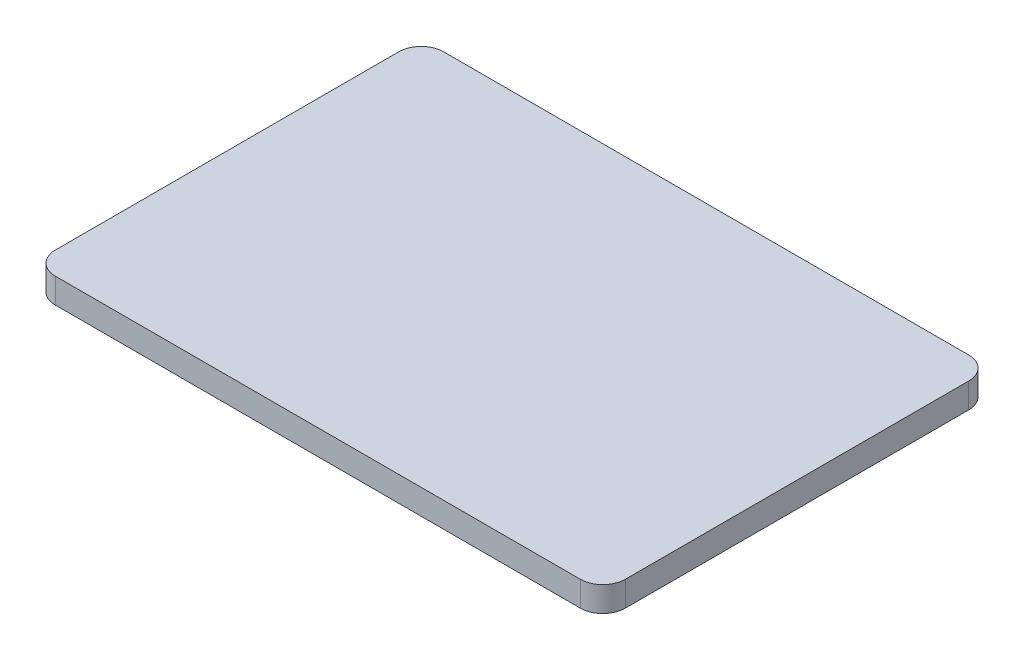
ISO-10303-21;
HEADER;
FILE_DESCRIPTION(('STEP AP214'),'2;1');
FILE_NAME('part.step','',(''),(''),'','','');
FILE_SCHEMA(('AUTOMOTIVE_DESIGN { 1 0 10303 214 1 1 1 1 }'));
ENDSEC;
DATA;
#1=APPLICATION_CONTEXT('core data for automotive mechanical design processes');
#2=APPLICATION_PROTOCOL_DEFINITION('international standard','automotive_design',2000,#1);
#3=PRODUCT_CONTEXT('',#1,'mechanical');
#4=PRODUCT('Part','Part','',(#3));
#5=PRODUCT_RELATED_PRODUCT_CATEGORY('part','',(#4));
#6=PRODUCT_DEFINITION_FORMATION('','',#4);
#7=PRODUCT_DEFINITION_CONTEXT('part definition',#1,'design');
#8=PRODUCT_DEFINITION('design','',#6,#7);
#9=PRODUCT_DEFINITION_SHAPE('','',#8);
#10=(LENGTH_UNIT() NAMED_UNIT(*) SI_UNIT(.MILLI.,.METRE.));
#11=(NAMED_UNIT(*) PLANE_ANGLE_UNIT() SI_UNIT($,.RADIAN.));
#12=(NAMED_UNIT(*) SI_UNIT($,.STERADIAN.) SOLID_ANGLE_UNIT());
#13=UNCERTAINTY_MEASURE_WITH_UNIT(LENGTH_MEASURE(1.E-05),#10,'distance_accuracy_value','');
#14=(GEOMETRIC_REPRESENTATION_CONTEXT(3) GLOBAL_UNCERTAINTY_ASSIGNED_CONTEXT((#13)) GLOBAL_UNIT_ASSIGNED_CONTEXT((#10,
#11,#12)) REPRESENTATION_CONTEXT('',''));
#15=CARTESIAN_POINT('',(0.,0.,0.));
#16=DIRECTION('',(0.,0.,1.));
#17=DIRECTION('',(1.,0.,0.));
#18=AXIS2_PLACEMENT_3D('',#15,#16,#17);
#19=CARTESIAN_POINT('',(-20.95,2.,-13.7));
#20=DIRECTION('',(0.,-1.,0.));
#21=DIRECTION('',(0.,0.,-1.));
#22=AXIS2_PLACEMENT_3D('',#19,#20,#21);
#23=CYLINDRICAL_SURFACE('',#22,1.8);
#24=CARTESIAN_POINT('',(-20.95,0.,-13.7));
#25=DIRECTION('',(0.,1.,0.));
#26=DIRECTION('',(0.,0.,1.));
#27=AXIS2_PLACEMENT_3D('',#24,#25,#26);
#28=CIRCLE('',#27,1.8);
#29=CARTESIAN_POINT('',(-20.95,0.,-15.5));
#30=VERTEX_POINT('',#29);
#31=CARTESIAN_POINT('',(-22.75,0.,-13.7));
#32=VERTEX_POINT('',#31);
#33=EDGE_CURVE('E144',#30,#32,#28,.T.);
#34=ORIENTED_EDGE('',*,*,#33,.T.);
#35=DIRECTION('',(0.,-1.,0.));
#36=VECTOR('',#35,1.);
#37=CARTESIAN_POINT('',(-22.75,2.,-13.7));
#38=LINE('',#37,#36);
#39=CARTESIAN_POINT('',(-22.75,2.,-13.7));
#40=VERTEX_POINT('',#39);
#41=EDGE_CURVE('E11',#40,#32,#38,.T.);
#42=ORIENTED_EDGE('',*,*,#41,.F.);
#43=CARTESIAN_POINT('',(-20.95,2.,-13.7));
#44=DIRECTION('',(0.,1.,0.));
#45=DIRECTION('',(0.,0.,1.));
#46=AXIS2_PLACEMENT_3D('',#43,#44,#45);
#47=CIRCLE('',#46,1.8);
#48=CARTESIAN_POINT('',(-20.95,2.,-15.5));
#49=VERTEX_POINT('',#48);
#50=EDGE_CURVE('E166',#49,#40,#47,.T.);
#51=ORIENTED_EDGE('',*,*,#50,.F.);
#52=DIRECTION('',(0.,-1.,0.));
#53=VECTOR('',#52,1.);
#54=CARTESIAN_POINT('',(-20.95,2.,-15.5));
#55=LINE('',#54,#53);
#56=EDGE_CURVE('E140',#49,#30,#55,.T.);
#57=ORIENTED_EDGE('',*,*,#56,.T.);
#58=EDGE_LOOP('',(#34,#42,#51,#57));
#59=FACE_BOUND('',#58,.T.);
#60=ADVANCED_FACE('F43',(#59),#23,.T.);
#61=CARTESIAN_POINT('',(-22.75,2.,-13.7));
#62=DIRECTION('',(1.,0.,0.));
#63=DIRECTION('',(0.,0.,-1.));
#64=AXIS2_PLACEMENT_3D('',#61,#62,#63);
#65=PLANE('',#64);
#66=DIRECTION('',(0.,0.,1.));
#67=VECTOR('',#66,1.);
#68=CARTESIAN_POINT('',(-22.75,0.,-13.7));
#69=LINE('',#68,#67);
#70=CARTESIAN_POINT('',(-22.75,0.,13.7));
#71=VERTEX_POINT('',#70);
#72=EDGE_CURVE('E148',#32,#71,#69,.T.);
#73=ORIENTED_EDGE('',*,*,#72,.T.);
#74=DIRECTION('',(0.,-1.,0.));
#75=VECTOR('',#74,1.);
#76=CARTESIAN_POINT('',(-22.75,2.,13.7));
#77=LINE('',#76,#75);
#78=CARTESIAN_POINT('',(-22.75,2.,13.7));
#79=VERTEX_POINT('',#78);
#80=EDGE_CURVE('E52',#79,#71,#77,.T.);
#81=ORIENTED_EDGE('',*,*,#80,.F.);
#82=DIRECTION('',(0.,0.,1.));
#83=VECTOR('',#82,1.);
#84=CARTESIAN_POINT('',(-22.75,2.,-13.7));
#85=LINE('',#84,#83);
#86=EDGE_CURVE('E103',#40,#79,#85,.T.);
#87=ORIENTED_EDGE('',*,*,#86,.F.);
#88=ORIENTED_EDGE('',*,*,#41,.T.);
#89=EDGE_LOOP('',(#73,#81,#87,#88));
#90=FACE_BOUND('',#89,.T.);
#91=ADVANCED_FACE('F212',(#90),#65,.F.);
#92=CARTESIAN_POINT('',(-20.95,2.,13.7));
#93=DIRECTION('',(0.,-1.,0.));
#94=DIRECTION('',(0.,0.,-1.));
#95=AXIS2_PLACEMENT_3D('',#92,#93,#94);
#96=CYLINDRICAL_SURFACE('',#95,1.8);
#97=CARTESIAN_POINT('',(-20.95,0.,13.7));
#98=DIRECTION('',(0.,1.,0.));
#99=DIRECTION('',(0.,0.,1.));
#100=AXIS2_PLACEMENT_3D('',#97,#98,#99);
#101=CIRCLE('',#100,1.8);
#102=CARTESIAN_POINT('',(-20.95,0.,15.5));
#103=VERTEX_POINT('',#102);
#104=EDGE_CURVE('E151',#71,#103,#101,.T.);
#105=ORIENTED_EDGE('',*,*,#104,.T.);
#106=DIRECTION('',(0.,-1.,0.));
#107=VECTOR('',#106,1.);
#108=CARTESIAN_POINT('',(-20.95,2.,15.5));
#109=LINE('',#108,#107);
#110=CARTESIAN_POINT('',(-20.95,2.,15.5));
#111=VERTEX_POINT('',#110);
#112=EDGE_CURVE('E177',#111,#103,#109,.T.);
#113=ORIENTED_EDGE('',*,*,#112,.F.);
#114=CARTESIAN_POINT('',(-20.95,2.,13.7));
#115=DIRECTION('',(0.,1.,0.));
#116=DIRECTION('',(0.,0.,1.));
#117=AXIS2_PLACEMENT_3D('',#114,#115,#116);
#118=CIRCLE('',#117,1.8);
#119=EDGE_CURVE('E187',#79,#111,#118,.T.);
#120=ORIENTED_EDGE('',*,*,#119,.F.);
#121=ORIENTED_EDGE('',*,*,#80,.T.);
#122=EDGE_LOOP('',(#105,#113,#120,#121));
#123=FACE_BOUND('',#122,.T.);
#124=ADVANCED_FACE('F185',(#123),#96,.T.);
#125=CARTESIAN_POINT('',(-20.95,2.,15.5));
#126=DIRECTION('',(0.,0.,-1.));
#127=DIRECTION('',(-1.,0.,0.));
#128=AXIS2_PLACEMENT_3D('',#125,#126,#127);
#129=PLANE('',#128);
#130=DIRECTION('',(1.,0.,0.));
#131=VECTOR('',#130,1.);
#132=CARTESIAN_POINT('',(-20.95,0.,15.5));
#133=LINE('',#132,#131);
#134=CARTESIAN_POINT('',(20.95,0.,15.5));
#135=VERTEX_POINT('',#134);
#136=EDGE_CURVE('E154',#103,#135,#133,.T.);
#137=ORIENTED_EDGE('',*,*,#136,.T.);
#138=DIRECTION('',(0.,-1.,0.));
#139=VECTOR('',#138,1.);
#140=CARTESIAN_POINT('',(20.95,2.,15.5));
#141=LINE('',#140,#139);
#142=CARTESIAN_POINT('',(20.95,2.,15.5));
#143=VERTEX_POINT('',#142);
#144=EDGE_CURVE('E173',#143,#135,#141,.T.);
#145=ORIENTED_EDGE('',*,*,#144,.F.);
#146=DIRECTION('',(1.,0.,0.));
#147=VECTOR('',#146,1.);
#148=CARTESIAN_POINT('',(-20.95,2.,15.5));
#149=LINE('',#148,#147);
#150=EDGE_CURVE('E200',#111,#143,#149,.T.);
#151=ORIENTED_EDGE('',*,*,#150,.F.);
#152=ORIENTED_EDGE('',*,*,#112,.T.);
#153=EDGE_LOOP('',(#137,#145,#151,#152));
#154=FACE_BOUND('',#153,.T.);
#155=ADVANCED_FACE('F195',(#154),#129,.F.);
#156=CARTESIAN_POINT('',(20.95,2.,13.7));
#157=DIRECTION('',(0.,-1.,0.));
#158=DIRECTION('',(0.,0.,-1.));
#159=AXIS2_PLACEMENT_3D('',#156,#157,#158);
#160=CYLINDRICAL_SURFACE('',#159,1.8);
#161=CARTESIAN_POINT('',(20.95,0.,13.7));
#162=DIRECTION('',(0.,1.,0.));
#163=DIRECTION('',(0.,0.,1.));
#164=AXIS2_PLACEMENT_3D('',#161,#162,#163);
#165=CIRCLE('',#164,1.8);
#166=CARTESIAN_POINT('',(22.75,0.,13.7));
#167=VERTEX_POINT('',#166);
#168=EDGE_CURVE('E157',#135,#167,#165,.T.);
#169=ORIENTED_EDGE('',*,*,#168,.T.);
#170=DIRECTION('',(0.,-1.,0.));
#171=VECTOR('',#170,1.);
#172=CARTESIAN_POINT('',(22.75,2.,13.7));
#173=LINE('',#172,#171);
#174=CARTESIAN_POINT('',(22.75,2.,13.7));
#175=VERTEX_POINT('',#174);
#176=EDGE_CURVE('E133',#175,#167,#173,.T.);
#177=ORIENTED_EDGE('',*,*,#176,.F.);
#178=CARTESIAN_POINT('',(20.95,2.,13.7));
#179=DIRECTION('',(0.,1.,0.));
#180=DIRECTION('',(0.,0.,1.));
#181=AXIS2_PLACEMENT_3D('',#178,#179,#180);
#182=CIRCLE('',#181,1.8);
#183=EDGE_CURVE('E122',#143,#175,#182,.T.);
#184=ORIENTED_EDGE('',*,*,#183,.F.);
#185=ORIENTED_EDGE('',*,*,#144,.T.);
#186=EDGE_LOOP('',(#169,#177,#184,#185));
#187=FACE_BOUND('',#186,.T.);
#188=ADVANCED_FACE('F198',(#187),#160,.T.);
#189=CARTESIAN_POINT('',(22.75,2.,-13.7));
#190=DIRECTION('',(-1.,0.,0.));
#191=DIRECTION('',(0.,0.,1.));
#192=AXIS2_PLACEMENT_3D('',#189,#190,#191);
#193=PLANE('',#192);
#194=DIRECTION('',(0.,0.,-1.));
#195=VECTOR('',#194,1.);
#196=CARTESIAN_POINT('',(22.75,0.,-13.7));
#197=LINE('',#196,#195);
#198=CARTESIAN_POINT('',(22.75,0.,-13.7));
#199=VERTEX_POINT('',#198);
#200=EDGE_CURVE('E131',#167,#199,#197,.T.);
#201=ORIENTED_EDGE('',*,*,#200,.T.);
#202=DIRECTION('',(0.,-1.,0.));
#203=VECTOR('',#202,1.);
#204=CARTESIAN_POINT('',(22.75,2.,-13.7));
#205=LINE('',#204,#203);
#206=CARTESIAN_POINT('',(22.75,2.,-13.7));
#207=VERTEX_POINT('',#206);
#208=EDGE_CURVE('E128',#207,#199,#205,.T.);
#209=ORIENTED_EDGE('',*,*,#208,.F.);
#210=DIRECTION('',(0.,0.,-1.));
#211=VECTOR('',#210,1.);
#212=CARTESIAN_POINT('',(22.75,2.,-13.7));
#213=LINE('',#212,#211);
#214=EDGE_CURVE('E116',#175,#207,#213,.T.);
#215=ORIENTED_EDGE('',*,*,#214,.F.);
#216=ORIENTED_EDGE('',*,*,#176,.T.);
#217=EDGE_LOOP('',(#201,#209,#215,#216));
#218=FACE_BOUND('',#217,.T.);
#219=ADVANCED_FACE('F129',(#218),#193,.F.);
#220=CARTESIAN_POINT('',(20.95,2.,-13.7));
#221=DIRECTION('',(0.,-1.,0.));
#222=DIRECTION('',(0.,0.,-1.));
#223=AXIS2_PLACEMENT_3D('',#220,#221,#222);
#224=CYLINDRICAL_SURFACE('',#223,1.8);
#225=CARTESIAN_POINT('',(20.95,0.,-13.7));
#226=DIRECTION('',(0.,1.,0.));
#227=DIRECTION('',(0.,0.,-1.));
#228=AXIS2_PLACEMENT_3D('',#225,#226,#227);
#229=CIRCLE('',#228,1.8);
#230=CARTESIAN_POINT('',(20.95,0.,-15.5));
#231=VERTEX_POINT('',#230);
#232=EDGE_CURVE('E89',#199,#231,#229,.T.);
#233=ORIENTED_EDGE('',*,*,#232,.T.);
#234=DIRECTION('',(0.,-1.,0.));
#235=VECTOR('',#234,1.);
#236=CARTESIAN_POINT('',(20.95,2.,-15.5));
#237=LINE('',#236,#235);
#238=CARTESIAN_POINT('',(20.95,2.,-15.5));
#239=VERTEX_POINT('',#238);
#240=EDGE_CURVE('E134',#239,#231,#237,.T.);
#241=ORIENTED_EDGE('',*,*,#240,.F.);
#242=CARTESIAN_POINT('',(20.95,2.,-13.7));
#243=DIRECTION('',(0.,1.,0.));
#244=DIRECTION('',(0.,0.,-1.));
#245=AXIS2_PLACEMENT_3D('',#242,#243,#244);
#246=CIRCLE('',#245,1.8);
#247=EDGE_CURVE('E120',#207,#239,#246,.T.);
#248=ORIENTED_EDGE('',*,*,#247,.F.);
#249=ORIENTED_EDGE('',*,*,#208,.T.);
#250=EDGE_LOOP('',(#233,#241,#248,#249));
#251=FACE_BOUND('',#250,.T.);
#252=ADVANCED_FACE('F136',(#251),#224,.T.);
#253=CARTESIAN_POINT('',(-20.95,2.,-15.5));
#254=DIRECTION('',(0.,0.,1.));
#255=DIRECTION('',(1.,0.,0.));
#256=AXIS2_PLACEMENT_3D('',#253,#254,#255);
#257=PLANE('',#256);
#258=DIRECTION('',(-1.,0.,0.));
#259=VECTOR('',#258,1.);
#260=CARTESIAN_POINT('',(-20.95,0.,-15.5));
#261=LINE('',#260,#259);
#262=EDGE_CURVE('E95',#231,#30,#261,.T.);
#263=ORIENTED_EDGE('',*,*,#262,.T.);
#264=ORIENTED_EDGE('',*,*,#56,.F.);
#265=DIRECTION('',(-1.,0.,0.));
#266=VECTOR('',#265,1.);
#267=CARTESIAN_POINT('',(-20.95,2.,-15.5));
#268=LINE('',#267,#266);
#269=EDGE_CURVE('E60',#239,#49,#268,.T.);
#270=ORIENTED_EDGE('',*,*,#269,.F.);
#271=ORIENTED_EDGE('',*,*,#240,.T.);
#272=EDGE_LOOP('',(#263,#264,#270,#271));
#273=FACE_BOUND('',#272,.T.);
#274=ADVANCED_FACE('F228',(#273),#257,.F.);
#275=CARTESIAN_POINT('',(-20.95,2.,-13.7));
#276=DIRECTION('',(0.,1.,0.));
#277=DIRECTION('',(0.,0.,1.));
#278=AXIS2_PLACEMENT_3D('',#275,#276,#277);
#279=PLANE('',#278);
#280=ORIENTED_EDGE('',*,*,#50,.T.);
#281=ORIENTED_EDGE('',*,*,#86,.T.);
#282=ORIENTED_EDGE('',*,*,#119,.T.);
#283=ORIENTED_EDGE('',*,*,#150,.T.);
#284=ORIENTED_EDGE('',*,*,#183,.T.);
#285=ORIENTED_EDGE('',*,*,#214,.T.);
#286=ORIENTED_EDGE('',*,*,#247,.T.);
#287=ORIENTED_EDGE('',*,*,#269,.T.);
#288=EDGE_LOOP('',(#280,#281,#282,#283,#284,#285,#286,#287));
#289=FACE_BOUND('',#288,.T.);
#290=ADVANCED_FACE('F118',(#289),#279,.T.);
#291=CARTESIAN_POINT('',(-20.95,0.,-13.7));
#292=DIRECTION('',(0.,1.,0.));
#293=DIRECTION('',(0.,0.,1.));
#294=AXIS2_PLACEMENT_3D('',#291,#292,#293);
#295=PLANE('',#294);
#296=ORIENTED_EDGE('',*,*,#33,.F.);
#297=ORIENTED_EDGE('',*,*,#262,.F.);
#298=ORIENTED_EDGE('',*,*,#232,.F.);
#299=ORIENTED_EDGE('',*,*,#200,.F.);
#300=ORIENTED_EDGE('',*,*,#168,.F.);
#301=ORIENTED_EDGE('',*,*,#136,.F.);
#302=ORIENTED_EDGE('',*,*,#104,.F.);
#303=ORIENTED_EDGE('',*,*,#72,.F.);
#304=EDGE_LOOP('',(#296,#297,#298,#299,#300,#301,#302,#303));
#305=FACE_BOUND('',#304,.T.);
#306=ADVANCED_FACE('F191',(#305),#295,.F.);
#307=CLOSED_SHELL('',(#60,#91,#124,#155,#188,#219,#252,#274,#290,#306));
#308=MANIFOLD_SOLID_BREP('B2',#307);
#309=ADVANCED_BREP_SHAPE_REPRESENTATION('',(#18,#308),#14);
#310=SHAPE_DEFINITION_REPRESENTATION(#9,#309);
ENDSEC;
END-ISO-10303-21;
